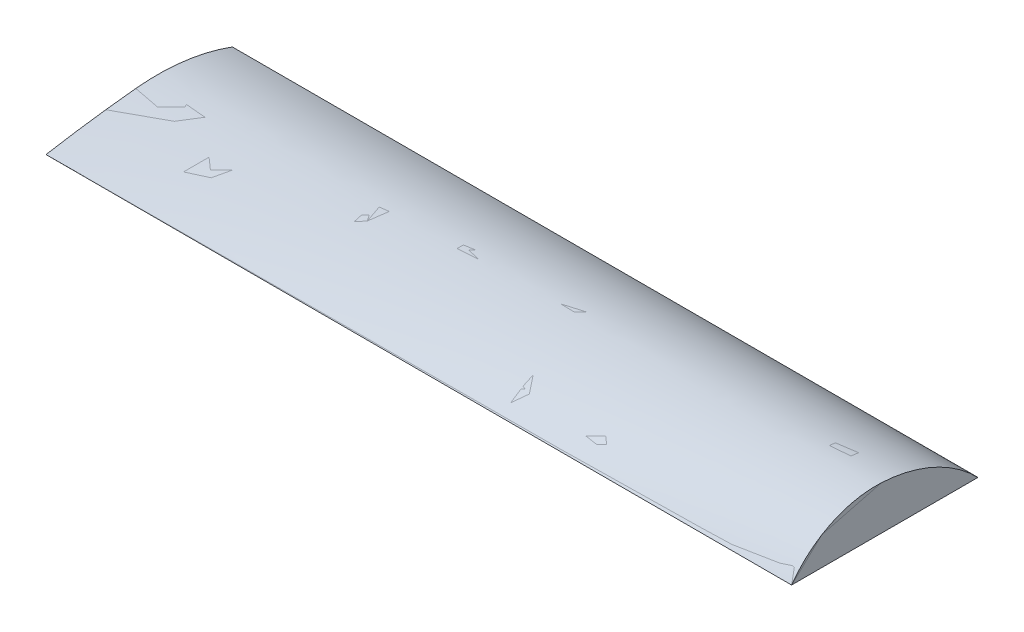
ISO-10303-21;
HEADER;
FILE_DESCRIPTION(('STEP AP214'),'2;1');
FILE_NAME('part.step','',(''),(''),'','','');
FILE_SCHEMA(('AUTOMOTIVE_DESIGN { 1 0 10303 214 1 1 1 1 }'));
ENDSEC;
DATA;
#1=APPLICATION_CONTEXT('core data for automotive mechanical design processes');
#2=APPLICATION_PROTOCOL_DEFINITION('international standard','automotive_design',2000,#1);
#3=PRODUCT_CONTEXT('',#1,'mechanical');
#4=PRODUCT('Part','Part','',(#3));
#5=PRODUCT_RELATED_PRODUCT_CATEGORY('part','',(#4));
#6=PRODUCT_DEFINITION_FORMATION('','',#4);
#7=PRODUCT_DEFINITION_CONTEXT('part definition',#1,'design');
#8=PRODUCT_DEFINITION('design','',#6,#7);
#9=PRODUCT_DEFINITION_SHAPE('','',#8);
#10=(LENGTH_UNIT() NAMED_UNIT(*) SI_UNIT(.MILLI.,.METRE.));
#11=(NAMED_UNIT(*) PLANE_ANGLE_UNIT() SI_UNIT($,.RADIAN.));
#12=(NAMED_UNIT(*) SI_UNIT($,.STERADIAN.) SOLID_ANGLE_UNIT());
#13=UNCERTAINTY_MEASURE_WITH_UNIT(LENGTH_MEASURE(1.E-05),#10,'distance_accuracy_value','');
#14=(GEOMETRIC_REPRESENTATION_CONTEXT(3) GLOBAL_UNCERTAINTY_ASSIGNED_CONTEXT((#13)) GLOBAL_UNIT_ASSIGNED_CONTEXT((#10,
#11,#12)) REPRESENTATION_CONTEXT('',''));
#15=CARTESIAN_POINT('',(0.,0.,0.));
#16=DIRECTION('',(0.,0.,1.));
#17=DIRECTION('',(1.,0.,0.));
#18=AXIS2_PLACEMENT_3D('',#15,#16,#17);
#19=CARTESIAN_POINT('',(3048.,1.66533453693773E-13,762.));
#20=CARTESIAN_POINT('',(2032.03577284706,2.0817105168036E-13,762.));
#21=CARTESIAN_POINT('',(0.250374671058595,2.91440384736842E-13,761.999999999999));
#22=CARTESIAN_POINT('',(-2031.96423722645,0.,762.));
#23=CARTESIAN_POINT('',(-3048.,0.,762.));
#24=CARTESIAN_POINT('',(3048.,28.671833931655,741.827661984878));
#25=CARTESIAN_POINT('',(2032.03577284706,24.0624009934024,738.640130733132));
#26=CARTESIAN_POINT('',(0.250374671058595,14.8441841630146,732.265517060289));
#27=CARTESIAN_POINT('',(-2031.96423722645,8.50190393747055,731.640753218689));
#28=CARTESIAN_POINT('',(-3048.,5.33098710173962,731.328393292411));
#29=CARTESIAN_POINT('',(3048.00000000001,83.769524545229,697.709712580137));
#30=CARTESIAN_POINT('',(2032.03577284706,70.0789648878222,689.336930818203));
#31=CARTESIAN_POINT('',(0.250374671056819,42.6997733165532,672.59254625096));
#32=CARTESIAN_POINT('',(-2031.96423722645,24.6915709213552,670.943225538692));
#33=CARTESIAN_POINT('',(-3048.,15.68810369419,670.118623246131));
#34=CARTESIAN_POINT('',(3047.99999999999,157.99751750129,621.128655633662));
#35=CARTESIAN_POINT('',(2032.03577284706,131.779115691589,608.273453183184));
#36=CARTESIAN_POINT('',(0.250374671059594,79.3460038390769,582.564858400598));
#37=CARTESIAN_POINT('',(-2031.96423722645,46.6758666482035,579.903749530428));
#38=CARTESIAN_POINT('',(-3048.,30.3419481898317,578.573288778449));
#39=CARTESIAN_POINT('',(3048.00000000001,222.279919150879,535.369393007971));
#40=CARTESIAN_POINT('',(2032.03577284706,185.244168138304,520.92397560719));
#41=CARTESIAN_POINT('',(0.25037467105693,111.177881051893,492.035174839361));
#42=CARTESIAN_POINT('',(-2031.96423722645,66.489381346988,488.789159035158));
#43=CARTESIAN_POINT('',(-3048.,44.1467047324924,487.166265407541));
#44=CARTESIAN_POINT('',(3047.99999999999,275.309295221943,441.924260732401));
#45=CARTESIAN_POINT('',(2032.03577284706,229.686447424571,428.261630719064));
#46=CARTESIAN_POINT('',(0.25037467106015,138.44717590251,400.938294503209));
#47=CARTESIAN_POINT('',(-2031.96423722645,84.2304676603532,397.49468300982));
#48=CARTESIAN_POINT('',(-3048.,57.124022213405,395.772998493875));
#49=CARTESIAN_POINT('',(3048.,316.055612497821,342.506731589206));
#50=CARTESIAN_POINT('',(2032.03577284706,264.480094401678,331.38854628934));
#51=CARTESIAN_POINT('',(0.250374671057263,161.336320467077,309.15374122166));
#52=CARTESIAN_POINT('',(-2031.96423722645,99.9743663587571,305.89712624075));
#53=CARTESIAN_POINT('',(-3048.,69.2955495238026,304.268933397918));
#54=CARTESIAN_POINT('',(3048.,343.807322771817,238.985135461588));
#55=CARTESIAN_POINT('',(2032.03577284706,289.179478189338,231.495468245787));
#56=CARTESIAN_POINT('',(0.250374671059261,179.931481074771,216.517188421006));
#57=CARTESIAN_POINT('',(-2031.96423722645,113.758313134514,213.857863659104));
#58=CARTESIAN_POINT('',(-3048.,80.6740587601479,212.52829489845));
#59=CARTESIAN_POINT('',(3048.,358.198120324975,133.309413712889));
#60=CARTESIAN_POINT('',(2032.03577284706,303.54035733276,129.820748734067));
#61=CARTESIAN_POINT('',(0.250374671057485,194.232527611479,122.843910009181));
#62=CARTESIAN_POINT('',(-2031.96423722645,125.590779549107,121.231470675774));
#63=CARTESIAN_POINT('',(-3048.,91.272322018904,120.425307774251));
#64=CARTESIAN_POINT('',(3048.,358.870781910046,62.731464205853));
#65=CARTESIAN_POINT('',(2032.03577284706,306.188595312572,61.6850049745001));
#66=CARTESIAN_POINT('',(0.250374671058595,200.831640203346,59.592233861872));
#67=CARTESIAN_POINT('',(-2031.96423722645,132.155626233426,58.9931181249794));
#68=CARTESIAN_POINT('',(-3048.,97.8200369557641,58.6935813481255));
#69=CARTESIAN_POINT('',(3048.,355.064795020661,-9.63791222482065));
#70=CARTESIAN_POINT('',(2032.03577284706,305.398061907244,-8.52134455437214));
#71=CARTESIAN_POINT('',(0.250374671058595,206.071589165451,-6.28836643539833));
#72=CARTESIAN_POINT('',(-2031.96423722645,138.236608549101,-5.64911242279499));
#73=CARTESIAN_POINT('',(-3048.,104.321506340034,-5.32950792113509));
#74=CARTESIAN_POINT('',(3048.,347.637479878169,-83.8260259239868));
#75=CARTESIAN_POINT('',(2032.03577284706,301.325409741574,-80.82706929388));
#76=CARTESIAN_POINT('',(0.250374671060594,208.707790589249,-74.829578311457));
#77=CARTESIAN_POINT('',(-2031.96423722646,142.352998457589,-72.810907499894));
#78=CARTESIAN_POINT('',(-3048.00000000001,109.177938381517,-71.8016431604845));
#79=CARTESIAN_POINT('',(3047.99999999999,326.318073523607,-192.835832411034));
#80=CARTESIAN_POINT('',(2032.03577284706,285.58617816961,-187.972037851483));
#81=CARTESIAN_POINT('',(0.250374671057152,204.128122847918,-178.245133594709));
#82=CARTESIAN_POINT('',(-2031.96423722645,141.894259590524,-174.195235973818));
#83=CARTESIAN_POINT('',(-3047.99999999999,110.779518876191,-172.170429738144));
#84=CARTESIAN_POINT('',(3048.,295.133818981261,-298.917482992077));
#85=CARTESIAN_POINT('',(2032.03577284706,260.397295855178,-293.075868027565));
#86=CARTESIAN_POINT('',(0.250374671061815,190.929140791531,-281.393460646035));
#87=CARTESIAN_POINT('',(-2031.96423722646,134.730065304401,-275.626334933244));
#88=CARTESIAN_POINT('',(-3048.00000000001,106.632506023288,-272.742975105842));
#89=CARTESIAN_POINT('',(3048.,254.375558981553,-401.436612924971));
#90=CARTESIAN_POINT('',(2032.03577284706,225.965418110304,-395.418312774942));
#91=CARTESIAN_POINT('',(0.250374671056153,169.149136749604,-383.382559901106));
#92=CARTESIAN_POINT('',(-2031.96423722645,120.862111727274,-376.495132867321));
#93=CARTESIAN_POINT('',(-3047.99999999999,96.7202991384844,-373.05166181911));
#94=CARTESIAN_POINT('',(3048.,204.334136254906,-499.758857467569));
#95=CARTESIAN_POINT('',(2032.03577284706,182.537352158644,-494.284600585119));
#96=CARTESIAN_POINT('',(0.25037467105915,138.946853132822,-483.336857640669));
#97=CARTESIAN_POINT('',(-2031.96423722646,100.366251747829,-476.197231441605));
#98=CARTESIAN_POINT('',(-3048.,81.0773092675554,-472.62766968931));
#99=CARTESIAN_POINT('',(3048.,145.293670384375,-593.246812366321));
#100=CARTESIAN_POINT('',(2032.03577284706,130.394644659157,-588.969148964709));
#101=CARTESIAN_POINT('',(0.250374671057041,100.598691114241,-580.414424491718));
#102=CARTESIAN_POINT('',(-2031.96423722645,73.3910460158653,-574.143728265384));
#103=CARTESIAN_POINT('',(-3048.,59.7881812992353,-571.008600909176));
#104=CARTESIAN_POINT('',(3048.,77.5382809530146,-681.263073367678));
#105=CARTESIAN_POINT('',(2032.03577284706,69.8558824452227,-678.782784450237));
#106=CARTESIAN_POINT('',(0.250374671059372,54.4921671746151,-673.822555860461));
#107=CARTESIAN_POINT('',(-2031.96423722646,40.154804863706,-669.771460622236));
#108=CARTESIAN_POINT('',(-3048.,32.9866284484584,-667.746055620056));
#109=CARTESIAN_POINT('',(3048.,26.7503319412117,-735.844939025949));
#110=CARTESIAN_POINT('',(2032.03577284706,24.1358965585415,-734.952256416352));
#111=CARTESIAN_POINT('',(0.250374671058595,18.9073939272333,-733.167016894222));
#112=CARTESIAN_POINT('',(-2031.96423722645,14.0113318394718,-731.626749227143));
#113=CARTESIAN_POINT('',(-3048.,11.5634731591918,-730.856669618013));
#114=CARTESIAN_POINT('',(3048.,2.22044604925031E-13,-762.));
#115=CARTESIAN_POINT('',(2032.03577284706,0.,-762.));
#116=CARTESIAN_POINT('',(0.250374671058595,-4.99609484557799E-13,-762.000000000001));
#117=CARTESIAN_POINT('',(-2031.96423722645,1.29537744272187E-13,-762.));
#118=CARTESIAN_POINT('',(-3048.,4.44089209850063E-13,-762.));
#119=B_SPLINE_SURFACE_WITH_KNOTS('',3,3,((#19,#20,#21,#22,#23),(#24,#25,#26,#27,#28),(#29,#30,
#31,#32,#33),(#34,#35,#36,#37,#38),(#39,#40,#41,#42,#43),(#44,#45,#46,#47,#48),(#49,#50,#51,#52,
#53),(#54,#55,#56,#57,#58),(#59,#60,#61,#62,#63),(#64,#65,#66,#67,#68),(#69,#70,#71,#72,#73),
(#74,#75,#76,#77,#78),(#79,#80,#81,#82,#83),(#84,#85,#86,#87,#88),(#89,#90,#91,#92,#93),(#94,
#95,#96,#97,#98),(#99,#100,#101,#102,#103),(#104,#105,#106,#107,#108),(#109,#110,#111,#112,
#113),(#114,#115,#116,#117,#118)),.UNSPECIFIED.,.F.,.F.,.F.,(4,1,1,1,1,1,1,1,2,1,1,1,1,1,1,1,4),
(4,1,4),(0.,0.0604742381198347,0.120948476239669,0.181422714359504,0.241896952479339,
0.302371190599174,0.362845428719008,0.423319666838843,0.483793904958678,0.548319666838843,
0.612845428719008,0.677371190599174,0.741896952479339,0.806422714359504,0.87094847623967,
0.935474238119835,1.),(0.,0.500035204537351,1.),.UNSPECIFIED.);
#120=CARTESIAN_POINT('',(3048.,-485.437757623856,72.0258998083268));
#121=DIRECTION('',(-1.,0.,0.));
#122=DIRECTION('',(0.,0.,-1.));
#123=AXIS2_PLACEMENT_3D('',#120,#121,#122);
#124=CIRCLE('',#123,843.631480838753);
#125=CARTESIAN_POINT('',(3048.,0.,762.));
#126=VERTEX_POINT('',#125);
#127=CARTESIAN_POINT('',(3048.,357.029468650607,27.7196009830028));
#128=VERTEX_POINT('',#127);
#129=EDGE_CURVE('E147',#126,#128,#124,.T.);
#130=CARTESIAN_POINT('',(3048.,-833.356731227227,90.3233498819976));
#131=DIRECTION('',(-1.,0.,0.));
#132=DIRECTION('',(0.,0.,-1.));
#133=AXIS2_PLACEMENT_3D('',#130,#131,#132);
#134=CIRCLE('',#133,1192.03126395066);
#135=CARTESIAN_POINT('',(3048.,2.22044604925031E-13,-762.));
#136=VERTEX_POINT('',#135);
#137=EDGE_CURVE('E168',#128,#136,#134,.T.);
#138=DIRECTION('',(-1.,0.,0.));
#139=VECTOR('',#138,1.);
#140=CARTESIAN_POINT('',(0.214606860223343,0.,-762.));
#141=LINE('',#140,#139);
#142=CARTESIAN_POINT('',(-3048.,2.22044604925031E-13,-762.));
#143=VERTEX_POINT('',#142);
#144=EDGE_CURVE('E180',#136,#143,#141,.T.);
#145=CARTESIAN_POINT('',(-3048.,-1648.45305250207,-149.931785297438));
#146=DIRECTION('',(-1.,0.,0.));
#147=DIRECTION('',(0.,0.,-1.));
#148=AXIS2_PLACEMENT_3D('',#145,#146,#147);
#149=CIRCLE('',#148,1758.41547017551);
#150=CARTESIAN_POINT('',(-3048.,100.965408217154,27.7196009829847));
#151=VERTEX_POINT('',#150);
#152=EDGE_CURVE('E255',#151,#143,#149,.T.);
#153=CARTESIAN_POINT('',(-3048.,-10303.5740928413,-1028.84914313158));
#154=DIRECTION('',(-1.,0.,0.));
#155=DIRECTION('',(0.,0.,-1.));
#156=AXIS2_PLACEMENT_3D('',#153,#154,#155);
#157=CIRCLE('',#156,10458.048562716);
#158=CARTESIAN_POINT('',(-3048.,0.,762.));
#159=VERTEX_POINT('',#158);
#160=EDGE_CURVE('E155',#159,#151,#157,.T.);
#161=DIRECTION('',(-1.,0.,0.));
#162=VECTOR('',#161,1.);
#163=CARTESIAN_POINT('',(0.214606860223343,0.,761.999999999999));
#164=LINE('',#163,#162);
#165=EDGE_CURVE('E171',#126,#159,#164,.T.);
#166=ORIENTED_EDGE('',*,*,#129,.T.);
#167=ORIENTED_EDGE('',*,*,#137,.T.);
#168=ORIENTED_EDGE('',*,*,#144,.T.);
#169=ORIENTED_EDGE('',*,*,#152,.F.);
#170=ORIENTED_EDGE('',*,*,#160,.F.);
#171=ORIENTED_EDGE('',*,*,#165,.F.);
#172=EDGE_LOOP('',(#166,#167,#168,#169,#170,#171));
#173=FACE_BOUND('',#172,.T.);
#174=ADVANCED_FACE('F129',(#173),#119,.T.);
#175=CARTESIAN_POINT('',(-3048.,103.318232930309,2.78389625575399));
#176=DIRECTION('',(1.,1.57666292950651E-12,2.7403747775986E-13));
#177=DIRECTION('',(-1.57666292950651E-12,1.,0.));
#178=AXIS2_PLACEMENT_3D('',#175,#176,#177);
#179=PLANE('',#178);
#180=ORIENTED_EDGE('',*,*,#160,.T.);
#181=ORIENTED_EDGE('',*,*,#152,.T.);
#182=DIRECTION('',(0.,0.,1.));
#183=VECTOR('',#182,1.);
#184=CARTESIAN_POINT('',(-3048.,1.11022302462516E-13,0.));
#185=LINE('',#184,#183);
#186=EDGE_CURVE('E140',#143,#159,#185,.T.);
#187=ORIENTED_EDGE('',*,*,#186,.T.);
#188=EDGE_LOOP('',(#180,#181,#187));
#189=FACE_BOUND('',#188,.T.);
#190=ADVANCED_FACE('F197',(#189),#179,.F.);
#191=CARTESIAN_POINT('',(3048.,355.219000396196,-0.376516263264786));
#192=DIRECTION('',(1.,8.75443960151328E-13,1.24430712112362E-12));
#193=DIRECTION('',(1.24430712112362E-12,0.,-1.));
#194=AXIS2_PLACEMENT_3D('',#191,#192,#193);
#195=PLANE('',#194);
#196=DIRECTION('',(0.,0.,1.));
#197=VECTOR('',#196,1.);
#198=CARTESIAN_POINT('',(3048.,1.11022302462516E-13,0.));
#199=LINE('',#198,#197);
#200=EDGE_CURVE('E15',#136,#126,#199,.T.);
#201=ORIENTED_EDGE('',*,*,#200,.F.);
#202=ORIENTED_EDGE('',*,*,#137,.F.);
#203=ORIENTED_EDGE('',*,*,#129,.F.);
#204=EDGE_LOOP('',(#201,#202,#203));
#205=FACE_BOUND('',#204,.T.);
#206=ADVANCED_FACE('F177',(#205),#195,.T.);
#207=CARTESIAN_POINT('',(3048.,2.22044604925031E-13,-762.));
#208=DIRECTION('',(0.,-1.,0.));
#209=DIRECTION('',(0.,0.,1.));
#210=AXIS2_PLACEMENT_3D('',#207,#208,#209);
#211=PLANE('',#210);
#212=ORIENTED_EDGE('',*,*,#200,.T.);
#213=ORIENTED_EDGE('',*,*,#165,.T.);
#214=ORIENTED_EDGE('',*,*,#186,.F.);
#215=ORIENTED_EDGE('',*,*,#144,.F.);
#216=EDGE_LOOP('',(#212,#213,#214,#215));
#217=FACE_BOUND('',#216,.T.);
#218=ADVANCED_FACE('F131',(#217),#211,.T.);
#219=CLOSED_SHELL('',(#174,#190,#206,#218));
#220=MANIFOLD_SOLID_BREP('B2',#219);
#221=CARTESIAN_POINT('',(3048.,1.66533453693773E-13,762.));
#222=CARTESIAN_POINT('',(2032.03577284706,2.0817105168036E-13,762.));
#223=CARTESIAN_POINT('',(0.250374671058595,2.91440384736842E-13,761.999999999999));
#224=CARTESIAN_POINT('',(-2031.96423722645,0.,762.));
#225=CARTESIAN_POINT('',(-3048.,0.,762.));
#226=CARTESIAN_POINT('',(3048.,28.671833931655,741.827661984878));
#227=CARTESIAN_POINT('',(2032.03577284706,24.0624009934024,738.640130733132));
#228=CARTESIAN_POINT('',(0.250374671058595,14.8441841630146,732.265517060289));
#229=CARTESIAN_POINT('',(-2031.96423722645,8.50190393747055,731.640753218689));
#230=CARTESIAN_POINT('',(-3048.,5.33098710173962,731.328393292411));
#231=CARTESIAN_POINT('',(3048.00000000001,83.769524545229,697.709712580137));
#232=CARTESIAN_POINT('',(2032.03577284706,70.0789648878222,689.336930818203));
#233=CARTESIAN_POINT('',(0.250374671056819,42.6997733165532,672.59254625096));
#234=CARTESIAN_POINT('',(-2031.96423722645,24.6915709213552,670.943225538692));
#235=CARTESIAN_POINT('',(-3048.,15.68810369419,670.118623246131));
#236=CARTESIAN_POINT('',(3047.99999999999,157.99751750129,621.128655633662));
#237=CARTESIAN_POINT('',(2032.03577284706,131.779115691589,608.273453183184));
#238=CARTESIAN_POINT('',(0.250374671059594,79.3460038390769,582.564858400598));
#239=CARTESIAN_POINT('',(-2031.96423722645,46.6758666482035,579.903749530428));
#240=CARTESIAN_POINT('',(-3048.,30.3419481898317,578.573288778449));
#241=CARTESIAN_POINT('',(3048.00000000001,222.279919150879,535.369393007971));
#242=CARTESIAN_POINT('',(2032.03577284706,185.244168138304,520.92397560719));
#243=CARTESIAN_POINT('',(0.25037467105693,111.177881051893,492.035174839361));
#244=CARTESIAN_POINT('',(-2031.96423722645,66.489381346988,488.789159035158));
#245=CARTESIAN_POINT('',(-3048.,44.1467047324924,487.166265407541));
#246=CARTESIAN_POINT('',(3047.99999999999,275.309295221943,441.924260732401));
#247=CARTESIAN_POINT('',(2032.03577284706,229.686447424571,428.261630719064));
#248=CARTESIAN_POINT('',(0.25037467106015,138.44717590251,400.938294503209));
#249=CARTESIAN_POINT('',(-2031.96423722645,84.2304676603532,397.49468300982));
#250=CARTESIAN_POINT('',(-3048.,57.124022213405,395.772998493875));
#251=CARTESIAN_POINT('',(3048.,316.055612497821,342.506731589206));
#252=CARTESIAN_POINT('',(2032.03577284706,264.480094401678,331.38854628934));
#253=CARTESIAN_POINT('',(0.250374671057263,161.336320467077,309.15374122166));
#254=CARTESIAN_POINT('',(-2031.96423722645,99.9743663587571,305.89712624075));
#255=CARTESIAN_POINT('',(-3048.,69.2955495238026,304.268933397918));
#256=CARTESIAN_POINT('',(3048.,343.807322771817,238.985135461588));
#257=CARTESIAN_POINT('',(2032.03577284706,289.179478189338,231.495468245787));
#258=CARTESIAN_POINT('',(0.250374671059261,179.931481074771,216.517188421006));
#259=CARTESIAN_POINT('',(-2031.96423722645,113.758313134514,213.857863659104));
#260=CARTESIAN_POINT('',(-3048.,80.6740587601479,212.52829489845));
#261=CARTESIAN_POINT('',(3048.,358.198120324975,133.309413712889));
#262=CARTESIAN_POINT('',(2032.03577284706,303.54035733276,129.820748734067));
#263=CARTESIAN_POINT('',(0.250374671057485,194.232527611479,122.843910009181));
#264=CARTESIAN_POINT('',(-2031.96423722645,125.590779549107,121.231470675774));
#265=CARTESIAN_POINT('',(-3048.,91.272322018904,120.425307774251));
#266=CARTESIAN_POINT('',(3048.,358.870781910046,62.731464205853));
#267=CARTESIAN_POINT('',(2032.03577284706,306.188595312572,61.6850049745001));
#268=CARTESIAN_POINT('',(0.250374671058595,200.831640203346,59.592233861872));
#269=CARTESIAN_POINT('',(-2031.96423722645,132.155626233426,58.9931181249794));
#270=CARTESIAN_POINT('',(-3048.,97.8200369557641,58.6935813481255));
#271=CARTESIAN_POINT('',(3048.,355.064795020661,-9.63791222482065));
#272=CARTESIAN_POINT('',(2032.03577284706,305.398061907244,-8.52134455437214));
#273=CARTESIAN_POINT('',(0.250374671058595,206.071589165451,-6.28836643539833));
#274=CARTESIAN_POINT('',(-2031.96423722645,138.236608549101,-5.64911242279499));
#275=CARTESIAN_POINT('',(-3048.,104.321506340034,-5.32950792113509));
#276=CARTESIAN_POINT('',(3048.,347.637479878169,-83.8260259239868));
#277=CARTESIAN_POINT('',(2032.03577284706,301.325409741574,-80.82706929388));
#278=CARTESIAN_POINT('',(0.250374671060594,208.707790589249,-74.829578311457));
#279=CARTESIAN_POINT('',(-2031.96423722646,142.352998457589,-72.810907499894));
#280=CARTESIAN_POINT('',(-3048.00000000001,109.177938381517,-71.8016431604845));
#281=CARTESIAN_POINT('',(3047.99999999999,326.318073523607,-192.835832411034));
#282=CARTESIAN_POINT('',(2032.03577284706,285.58617816961,-187.972037851483));
#283=CARTESIAN_POINT('',(0.250374671057152,204.128122847918,-178.245133594709));
#284=CARTESIAN_POINT('',(-2031.96423722645,141.894259590524,-174.195235973818));
#285=CARTESIAN_POINT('',(-3047.99999999999,110.779518876191,-172.170429738144));
#286=CARTESIAN_POINT('',(3048.,295.133818981261,-298.917482992077));
#287=CARTESIAN_POINT('',(2032.03577284706,260.397295855178,-293.075868027565));
#288=CARTESIAN_POINT('',(0.250374671061815,190.929140791531,-281.393460646035));
#289=CARTESIAN_POINT('',(-2031.96423722646,134.730065304401,-275.626334933244));
#290=CARTESIAN_POINT('',(-3048.00000000001,106.632506023288,-272.742975105842));
#291=CARTESIAN_POINT('',(3048.,254.375558981553,-401.436612924971));
#292=CARTESIAN_POINT('',(2032.03577284706,225.965418110304,-395.418312774942));
#293=CARTESIAN_POINT('',(0.250374671056153,169.149136749604,-383.382559901106));
#294=CARTESIAN_POINT('',(-2031.96423722645,120.862111727274,-376.495132867321));
#295=CARTESIAN_POINT('',(-3047.99999999999,96.7202991384844,-373.05166181911));
#296=CARTESIAN_POINT('',(3048.,204.334136254906,-499.758857467569));
#297=CARTESIAN_POINT('',(2032.03577284706,182.537352158644,-494.284600585119));
#298=CARTESIAN_POINT('',(0.25037467105915,138.946853132822,-483.336857640669));
#299=CARTESIAN_POINT('',(-2031.96423722646,100.366251747829,-476.197231441605));
#300=CARTESIAN_POINT('',(-3048.,81.0773092675554,-472.62766968931));
#301=CARTESIAN_POINT('',(3048.,145.293670384375,-593.246812366321));
#302=CARTESIAN_POINT('',(2032.03577284706,130.394644659157,-588.969148964709));
#303=CARTESIAN_POINT('',(0.250374671057041,100.598691114241,-580.414424491718));
#304=CARTESIAN_POINT('',(-2031.96423722645,73.3910460158653,-574.143728265384));
#305=CARTESIAN_POINT('',(-3048.,59.7881812992353,-571.008600909176));
#306=CARTESIAN_POINT('',(3048.,77.5382809530146,-681.263073367678));
#307=CARTESIAN_POINT('',(2032.03577284706,69.8558824452227,-678.782784450237));
#308=CARTESIAN_POINT('',(0.250374671059372,54.4921671746151,-673.822555860461));
#309=CARTESIAN_POINT('',(-2031.96423722646,40.154804863706,-669.771460622236));
#310=CARTESIAN_POINT('',(-3048.,32.9866284484584,-667.746055620056));
#311=CARTESIAN_POINT('',(3048.,26.7503319412117,-735.844939025949));
#312=CARTESIAN_POINT('',(2032.03577284706,24.1358965585415,-734.952256416352));
#313=CARTESIAN_POINT('',(0.250374671058595,18.9073939272333,-733.167016894222));
#314=CARTESIAN_POINT('',(-2031.96423722645,14.0113318394718,-731.626749227143));
#315=CARTESIAN_POINT('',(-3048.,11.5634731591918,-730.856669618013));
#316=CARTESIAN_POINT('',(3048.,2.22044604925031E-13,-762.));
#317=CARTESIAN_POINT('',(2032.03577284706,0.,-762.));
#318=CARTESIAN_POINT('',(0.250374671058595,-4.99609484557799E-13,-762.000000000001));
#319=CARTESIAN_POINT('',(-2031.96423722645,1.29537744272187E-13,-762.));
#320=CARTESIAN_POINT('',(-3048.,4.44089209850063E-13,-762.));
#321=B_SPLINE_SURFACE_WITH_KNOTS('',3,3,((#221,#222,#223,#224,#225),(#226,#227,#228,#229,#230),
(#231,#232,#233,#234,#235),(#236,#237,#238,#239,#240),(#241,#242,#243,#244,#245),(#246,#247,
#248,#249,#250),(#251,#252,#253,#254,#255),(#256,#257,#258,#259,#260),(#261,#262,#263,#264,
#265),(#266,#267,#268,#269,#270),(#271,#272,#273,#274,#275),(#276,#277,#278,#279,#280),(#281,
#282,#283,#284,#285),(#286,#287,#288,#289,#290),(#291,#292,#293,#294,#295),(#296,#297,#298,#299,
#300),(#301,#302,#303,#304,#305),(#306,#307,#308,#309,#310),(#311,#312,#313,#314,#315),(#316,
#317,#318,#319,#320)),.UNSPECIFIED.,.F.,.F.,.F.,(4,1,1,1,1,1,1,1,2,1,1,1,1,1,1,1,4),(4,1,4),(0.,
0.0604742381198347,0.120948476239669,0.181422714359504,0.241896952479339,0.302371190599174,
0.362845428719008,0.423319666838843,0.483793904958678,0.548319666838843,0.612845428719008,
0.677371190599174,0.741896952479339,0.806422714359504,0.87094847623967,0.935474238119835,1.),
(0.,0.500035204537351,1.),.UNSPECIFIED.);
#322=CARTESIAN_POINT('',(3048.,-485.437757623856,72.0258998083268));
#323=DIRECTION('',(-1.,0.,0.));
#324=DIRECTION('',(0.,0.,-1.));
#325=AXIS2_PLACEMENT_3D('',#322,#323,#324);
#326=CIRCLE('',#325,843.631480838753);
#327=CARTESIAN_POINT('',(3048.,0.,762.));
#328=VERTEX_POINT('',#327);
#329=CARTESIAN_POINT('',(3048.,357.029468650607,27.7196009830028));
#330=VERTEX_POINT('',#329);
#331=EDGE_CURVE('E127',#328,#330,#326,.T.);
#332=CARTESIAN_POINT('',(3048.,-833.356731227227,90.3233498819976));
#333=DIRECTION('',(-1.,0.,0.));
#334=DIRECTION('',(0.,0.,-1.));
#335=AXIS2_PLACEMENT_3D('',#332,#333,#334);
#336=CIRCLE('',#335,1192.03126395066);
#337=CARTESIAN_POINT('',(3048.,2.22044604925031E-13,-762.));
#338=VERTEX_POINT('',#337);
#339=EDGE_CURVE('E421',#330,#338,#336,.T.);
#340=DIRECTION('',(-1.,0.,0.));
#341=VECTOR('',#340,1.);
#342=CARTESIAN_POINT('',(0.214606860223343,0.,-762.));
#343=LINE('',#342,#341);
#344=CARTESIAN_POINT('',(-3048.,2.22044604925031E-13,-762.));
#345=VERTEX_POINT('',#344);
#346=EDGE_CURVE('E457',#338,#345,#343,.T.);
#347=CARTESIAN_POINT('',(-3048.,-1648.45305250207,-149.931785297438));
#348=DIRECTION('',(-1.,0.,0.));
#349=DIRECTION('',(0.,0.,-1.));
#350=AXIS2_PLACEMENT_3D('',#347,#348,#349);
#351=CIRCLE('',#350,1758.41547017551);
#352=CARTESIAN_POINT('',(-3048.,100.965408217154,27.7196009829847));
#353=VERTEX_POINT('',#352);
#354=EDGE_CURVE('E429',#353,#345,#351,.T.);
#355=CARTESIAN_POINT('',(-3048.,-10303.5740928413,-1028.84914313158));
#356=DIRECTION('',(-1.,0.,0.));
#357=DIRECTION('',(0.,0.,-1.));
#358=AXIS2_PLACEMENT_3D('',#355,#356,#357);
#359=CIRCLE('',#358,10458.048562716);
#360=CARTESIAN_POINT('',(-3048.,0.,762.));
#361=VERTEX_POINT('',#360);
#362=EDGE_CURVE('E469',#361,#353,#359,.T.);
#363=DIRECTION('',(-1.,0.,0.));
#364=VECTOR('',#363,1.);
#365=CARTESIAN_POINT('',(0.214606860223343,0.,761.999999999999));
#366=LINE('',#365,#364);
#367=EDGE_CURVE('E455',#328,#361,#366,.T.);
#368=ORIENTED_EDGE('',*,*,#331,.T.);
#369=ORIENTED_EDGE('',*,*,#339,.T.);
#370=ORIENTED_EDGE('',*,*,#346,.T.);
#371=ORIENTED_EDGE('',*,*,#354,.F.);
#372=ORIENTED_EDGE('',*,*,#362,.F.);
#373=ORIENTED_EDGE('',*,*,#367,.F.);
#374=EDGE_LOOP('',(#368,#369,#370,#371,#372,#373));
#375=FACE_BOUND('',#374,.T.);
#376=ADVANCED_FACE('F410',(#375),#321,.T.);
#377=CARTESIAN_POINT('',(3048.,2.22044604925031E-13,-762.));
#378=DIRECTION('',(0.,-1.,0.));
#379=DIRECTION('',(0.,0.,1.));
#380=AXIS2_PLACEMENT_3D('',#377,#378,#379);
#381=PLANE('',#380);
#382=DIRECTION('',(0.,0.,1.));
#383=VECTOR('',#382,1.);
#384=CARTESIAN_POINT('',(3048.,1.11022302462516E-13,0.));
#385=LINE('',#384,#383);
#386=EDGE_CURVE('E451',#338,#328,#385,.T.);
#387=ORIENTED_EDGE('',*,*,#386,.T.);
#388=ORIENTED_EDGE('',*,*,#367,.T.);
#389=DIRECTION('',(0.,0.,1.));
#390=VECTOR('',#389,1.);
#391=CARTESIAN_POINT('',(-3048.,1.11022302462516E-13,0.));
#392=LINE('',#391,#390);
#393=EDGE_CURVE('E545',#345,#361,#392,.T.);
#394=ORIENTED_EDGE('',*,*,#393,.F.);
#395=ORIENTED_EDGE('',*,*,#346,.F.);
#396=EDGE_LOOP('',(#387,#388,#394,#395));
#397=FACE_BOUND('',#396,.T.);
#398=ADVANCED_FACE('F412',(#397),#381,.T.);
#399=CARTESIAN_POINT('',(3048.,355.219000396196,-0.376516263264786));
#400=DIRECTION('',(1.,8.75443960151328E-13,1.24430712112362E-12));
#401=DIRECTION('',(1.24430712112362E-12,0.,-1.));
#402=AXIS2_PLACEMENT_3D('',#399,#400,#401);
#403=PLANE('',#402);
#404=ORIENTED_EDGE('',*,*,#386,.F.);
#405=ORIENTED_EDGE('',*,*,#339,.F.);
#406=ORIENTED_EDGE('',*,*,#331,.F.);
#407=EDGE_LOOP('',(#404,#405,#406));
#408=FACE_BOUND('',#407,.T.);
#409=ADVANCED_FACE('F464',(#408),#403,.T.);
#410=CARTESIAN_POINT('',(-3048.,103.318232930309,2.78389625575399));
#411=DIRECTION('',(1.,1.57666292950651E-12,2.7403747775986E-13));
#412=DIRECTION('',(-1.57666292950651E-12,1.,0.));
#413=AXIS2_PLACEMENT_3D('',#410,#411,#412);
#414=PLANE('',#413);
#415=ORIENTED_EDGE('',*,*,#362,.T.);
#416=ORIENTED_EDGE('',*,*,#354,.T.);
#417=ORIENTED_EDGE('',*,*,#393,.T.);
#418=EDGE_LOOP('',(#415,#416,#417));
#419=FACE_BOUND('',#418,.T.);
#420=ADVANCED_FACE('F557',(#419),#414,.F.);
#421=CLOSED_SHELL('',(#376,#398,#409,#420));
#422=MANIFOLD_SOLID_BREP('B9',#421);
#423=ADVANCED_BREP_SHAPE_REPRESENTATION('',(#18,#220,#422),#14);
#424=SHAPE_DEFINITION_REPRESENTATION(#9,#423);
ENDSEC;
END-ISO-10303-21;
